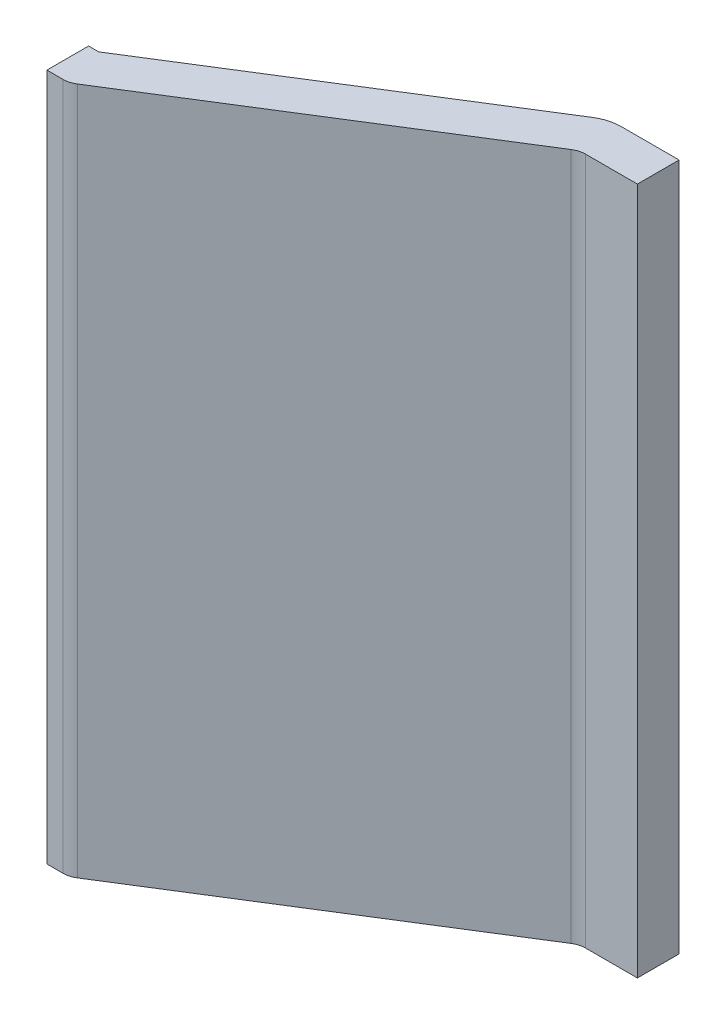
ISO-10303-21;
HEADER;
FILE_DESCRIPTION(('STEP AP214'),'2;1');
FILE_NAME('part.step','',(''),(''),'','','');
FILE_SCHEMA(('AUTOMOTIVE_DESIGN { 1 0 10303 214 1 1 1 1 }'));
ENDSEC;
DATA;
#1=APPLICATION_CONTEXT('core data for automotive mechanical design processes');
#2=APPLICATION_PROTOCOL_DEFINITION('international standard','automotive_design',2000,#1);
#3=PRODUCT_CONTEXT('',#1,'mechanical');
#4=PRODUCT('Part','Part','',(#3));
#5=PRODUCT_RELATED_PRODUCT_CATEGORY('part','',(#4));
#6=PRODUCT_DEFINITION_FORMATION('','',#4);
#7=PRODUCT_DEFINITION_CONTEXT('part definition',#1,'design');
#8=PRODUCT_DEFINITION('design','',#6,#7);
#9=PRODUCT_DEFINITION_SHAPE('','',#8);
#10=(LENGTH_UNIT() NAMED_UNIT(*) SI_UNIT(.MILLI.,.METRE.));
#11=(NAMED_UNIT(*) PLANE_ANGLE_UNIT() SI_UNIT($,.RADIAN.));
#12=(NAMED_UNIT(*) SI_UNIT($,.STERADIAN.) SOLID_ANGLE_UNIT());
#13=UNCERTAINTY_MEASURE_WITH_UNIT(LENGTH_MEASURE(1.E-05),#10,'distance_accuracy_value','');
#14=(GEOMETRIC_REPRESENTATION_CONTEXT(3) GLOBAL_UNCERTAINTY_ASSIGNED_CONTEXT((#13)) GLOBAL_UNIT_ASSIGNED_CONTEXT((#10,
#11,#12)) REPRESENTATION_CONTEXT('',''));
#15=CARTESIAN_POINT('',(0.,0.,0.));
#16=DIRECTION('',(0.,0.,1.));
#17=DIRECTION('',(1.,0.,0.));
#18=AXIS2_PLACEMENT_3D('',#15,#16,#17);
#19=CARTESIAN_POINT('',(1.824104576066,-1.525,0.964303036979));
#20=DIRECTION('',(0.,1.,0.));
#21=DIRECTION('',(0.530661276733133,0.,0.847583983671212));
#22=AXIS2_PLACEMENT_3D('',#19,#20,#21);
#23=CYLINDRICAL_SURFACE('',#22,0.0925);
#24=DIRECTION('',(0.,1.,0.));
#25=VECTOR('',#24,1.);
#26=CARTESIAN_POINT('',(1.873190744164,-1.525,1.042704555469));
#27=LINE('',#26,#25);
#28=CARTESIAN_POINT('',(1.873190744164,-1.525,1.042704555469));
#29=VERTEX_POINT('',#28);
#30=CARTESIAN_POINT('',(1.873190744164,1.525,1.042704555469));
#31=VERTEX_POINT('',#30);
#32=EDGE_CURVE('E25',#29,#31,#27,.T.);
#33=ORIENTED_EDGE('',*,*,#32,.T.);
#34=CARTESIAN_POINT('',(1.824104576066,1.525,0.964303036979));
#35=DIRECTION('',(0.,-1.,0.));
#36=DIRECTION('',(0.,0.,1.));
#37=AXIS2_PLACEMENT_3D('',#34,#35,#36);
#38=CIRCLE('',#37,0.0925);
#39=CARTESIAN_POINT('',(1.824104576066,1.525,1.056803036979));
#40=VERTEX_POINT('',#39);
#41=EDGE_CURVE('E178',#31,#40,#38,.T.);
#42=ORIENTED_EDGE('',*,*,#41,.T.);
#43=DIRECTION('',(0.,1.,0.));
#44=VECTOR('',#43,1.);
#45=CARTESIAN_POINT('',(1.824104576066,-1.525,1.056803036979));
#46=LINE('',#45,#44);
#47=CARTESIAN_POINT('',(1.824104576066,-1.525,1.056803036979));
#48=VERTEX_POINT('',#47);
#49=EDGE_CURVE('E11',#48,#40,#46,.T.);
#50=ORIENTED_EDGE('',*,*,#49,.F.);
#51=CARTESIAN_POINT('',(1.824104576066,-1.525,0.964303036979));
#52=DIRECTION('',(0.,-1.,0.));
#53=DIRECTION('',(0.,0.,1.));
#54=AXIS2_PLACEMENT_3D('',#51,#52,#53);
#55=CIRCLE('',#54,0.0925);
#56=EDGE_CURVE('E193',#29,#48,#55,.T.);
#57=ORIENTED_EDGE('',*,*,#56,.F.);
#58=EDGE_LOOP('',(#33,#42,#50,#57));
#59=FACE_BOUND('',#58,.T.);
#60=ADVANCED_FACE('F17',(#59),#23,.T.);
#61=CARTESIAN_POINT('',(1.7525,-1.525,1.056803036979));
#62=DIRECTION('',(0.,0.,1.));
#63=DIRECTION('',(1.,0.,0.));
#64=AXIS2_PLACEMENT_3D('',#61,#62,#63);
#65=PLANE('',#64);
#66=DIRECTION('',(1.,0.,0.));
#67=VECTOR('',#66,1.);
#68=CARTESIAN_POINT('',(1.7525,1.525,1.056803036979));
#69=LINE('',#68,#67);
#70=CARTESIAN_POINT('',(1.7525,1.525,1.056803036979));
#71=VERTEX_POINT('',#70);
#72=EDGE_CURVE('E187',#71,#40,#69,.T.);
#73=ORIENTED_EDGE('',*,*,#72,.F.);
#74=DIRECTION('',(0.,1.,0.));
#75=VECTOR('',#74,1.);
#76=CARTESIAN_POINT('',(1.7525,-1.525,1.056803036979));
#77=LINE('',#76,#75);
#78=CARTESIAN_POINT('',(1.7525,-1.525,1.056803036979));
#79=VERTEX_POINT('',#78);
#80=EDGE_CURVE('E250',#79,#71,#77,.T.);
#81=ORIENTED_EDGE('',*,*,#80,.F.);
#82=DIRECTION('',(1.,0.,0.));
#83=VECTOR('',#82,1.);
#84=CARTESIAN_POINT('',(1.7525,-1.525,1.056803036979));
#85=LINE('',#84,#83);
#86=EDGE_CURVE('E197',#79,#48,#85,.T.);
#87=ORIENTED_EDGE('',*,*,#86,.T.);
#88=ORIENTED_EDGE('',*,*,#49,.T.);
#89=EDGE_LOOP('',(#73,#81,#87,#88));
#90=FACE_BOUND('',#89,.T.);
#91=ADVANCED_FACE('F265',(#90),#65,.T.);
#92=CARTESIAN_POINT('',(3.288172336196,-1.525,0.156803036979));
#93=DIRECTION('',(0.530661276733133,0.,0.847583983671212));
#94=DIRECTION('',(0.,-1.,0.));
#95=AXIS2_PLACEMENT_3D('',#92,#93,#94);
#96=PLANE('',#95);
#97=DIRECTION('',(-0.847583983671212,0.,0.530661276733133));
#98=VECTOR('',#97,1.);
#99=CARTESIAN_POINT('',(3.288172336196,-1.525,0.156803036979));
#100=LINE('',#99,#98);
#101=CARTESIAN_POINT('',(3.220617112292,-1.525,0.19909848151));
#102=VERTEX_POINT('',#101);
#103=EDGE_CURVE('E198',#102,#29,#100,.T.);
#104=ORIENTED_EDGE('',*,*,#103,.F.);
#105=DIRECTION('',(0.,1.,0.));
#106=VECTOR('',#105,1.);
#107=CARTESIAN_POINT('',(3.220617112292,-1.525,0.19909848151));
#108=LINE('',#107,#106);
#109=CARTESIAN_POINT('',(3.220617112292,1.525,0.19909848151));
#110=VERTEX_POINT('',#109);
#111=EDGE_CURVE('E141',#102,#110,#108,.T.);
#112=ORIENTED_EDGE('',*,*,#111,.T.);
#113=DIRECTION('',(-0.847583983671212,0.,0.530661276733133));
#114=VECTOR('',#113,1.);
#115=CARTESIAN_POINT('',(3.288172336196,1.525,0.156803036979));
#116=LINE('',#115,#114);
#117=EDGE_CURVE('E174',#110,#31,#116,.T.);
#118=ORIENTED_EDGE('',*,*,#117,.T.);
#119=ORIENTED_EDGE('',*,*,#32,.F.);
#120=EDGE_LOOP('',(#104,#112,#118,#119));
#121=FACE_BOUND('',#120,.T.);
#122=ADVANCED_FACE('F259',(#121),#96,.T.);
#123=CARTESIAN_POINT('',(1.7525,-1.525,0.871803036979));
#124=DIRECTION('',(1.,0.,0.));
#125=DIRECTION('',(0.,1.,0.));
#126=AXIS2_PLACEMENT_3D('',#123,#124,#125);
#127=PLANE('',#126);
#128=DIRECTION('',(0.,0.,1.));
#129=VECTOR('',#128,1.);
#130=CARTESIAN_POINT('',(1.7525,-1.525,0.871803036979));
#131=LINE('',#130,#129);
#132=CARTESIAN_POINT('',(1.7525,-1.525,0.871803036979));
#133=VERTEX_POINT('',#132);
#134=EDGE_CURVE('E223',#133,#79,#131,.T.);
#135=ORIENTED_EDGE('',*,*,#134,.T.);
#136=ORIENTED_EDGE('',*,*,#80,.T.);
#137=DIRECTION('',(0.,0.,1.));
#138=VECTOR('',#137,1.);
#139=CARTESIAN_POINT('',(1.7525,1.525,0.871803036979));
#140=LINE('',#139,#138);
#141=CARTESIAN_POINT('',(1.7525,1.525,0.871803036979));
#142=VERTEX_POINT('',#141);
#143=EDGE_CURVE('E203',#142,#71,#140,.T.);
#144=ORIENTED_EDGE('',*,*,#143,.F.);
#145=DIRECTION('',(0.,1.,0.));
#146=VECTOR('',#145,1.);
#147=CARTESIAN_POINT('',(1.7525,-1.525,0.871803036979));
#148=LINE('',#147,#146);
#149=EDGE_CURVE('E190',#133,#142,#148,.T.);
#150=ORIENTED_EDGE('',*,*,#149,.F.);
#151=EDGE_LOOP('',(#135,#136,#144,#150));
#152=FACE_BOUND('',#151,.T.);
#153=ADVANCED_FACE('F290',(#152),#127,.F.);
#154=CARTESIAN_POINT('',(1.7525,-1.525,0.871803036979));
#155=DIRECTION('',(0.,0.,1.));
#156=DIRECTION('',(1.,0.,0.));
#157=AXIS2_PLACEMENT_3D('',#154,#155,#156);
#158=PLANE('',#157);
#159=DIRECTION('',(0.,1.,0.));
#160=VECTOR('',#159,1.);
#161=CARTESIAN_POINT('',(1.797536815936,-1.525,0.871803036979));
#162=LINE('',#161,#160);
#163=CARTESIAN_POINT('',(1.797536815936,-1.525,0.871803036979));
#164=VERTEX_POINT('',#163);
#165=CARTESIAN_POINT('',(1.797536815936,1.525,0.871803036979));
#166=VERTEX_POINT('',#165);
#167=EDGE_CURVE('E47',#164,#166,#162,.T.);
#168=ORIENTED_EDGE('',*,*,#167,.F.);
#169=DIRECTION('',(1.,0.,0.));
#170=VECTOR('',#169,1.);
#171=CARTESIAN_POINT('',(1.7525,-1.525,0.871803036979));
#172=LINE('',#171,#170);
#173=EDGE_CURVE('E218',#133,#164,#172,.T.);
#174=ORIENTED_EDGE('',*,*,#173,.F.);
#175=ORIENTED_EDGE('',*,*,#149,.T.);
#176=DIRECTION('',(1.,0.,0.));
#177=VECTOR('',#176,1.);
#178=CARTESIAN_POINT('',(1.7525,1.525,0.871803036979));
#179=LINE('',#178,#177);
#180=EDGE_CURVE('E202',#142,#166,#179,.T.);
#181=ORIENTED_EDGE('',*,*,#180,.T.);
#182=EDGE_LOOP('',(#168,#174,#175,#181));
#183=FACE_BOUND('',#182,.T.);
#184=ADVANCED_FACE('F361',(#183),#158,.F.);
#185=CARTESIAN_POINT('',(3.19,-1.525,0.));
#186=DIRECTION('',(0.530661276733133,0.,0.847583983671212));
#187=DIRECTION('',(0.,-1.,0.));
#188=AXIS2_PLACEMENT_3D('',#185,#186,#187);
#189=PLANE('',#188);
#190=ORIENTED_EDGE('',*,*,#167,.T.);
#191=DIRECTION('',(-0.847583983671212,0.,0.530661276733133));
#192=VECTOR('',#191,1.);
#193=CARTESIAN_POINT('',(3.19,1.525,0.));
#194=LINE('',#193,#192);
#195=CARTESIAN_POINT('',(3.144963184064,1.525,0.02819696302084));
#196=VERTEX_POINT('',#195);
#197=EDGE_CURVE('E182',#196,#166,#194,.T.);
#198=ORIENTED_EDGE('',*,*,#197,.F.);
#199=DIRECTION('',(0.,1.,0.));
#200=VECTOR('',#199,1.);
#201=CARTESIAN_POINT('',(3.144963184064,-1.525,0.02819696302084));
#202=LINE('',#201,#200);
#203=CARTESIAN_POINT('',(3.144963184064,-1.525,0.02819696302084));
#204=VERTEX_POINT('',#203);
#205=EDGE_CURVE('E37',#204,#196,#202,.T.);
#206=ORIENTED_EDGE('',*,*,#205,.F.);
#207=DIRECTION('',(-0.847583983671212,0.,0.530661276733133));
#208=VECTOR('',#207,1.);
#209=CARTESIAN_POINT('',(3.19,-1.525,0.));
#210=LINE('',#209,#208);
#211=EDGE_CURVE('E222',#204,#164,#210,.T.);
#212=ORIENTED_EDGE('',*,*,#211,.T.);
#213=EDGE_LOOP('',(#190,#198,#206,#212));
#214=FACE_BOUND('',#213,.T.);
#215=ADVANCED_FACE('F350',(#214),#189,.F.);
#216=CARTESIAN_POINT('',(3.24313552026,-1.525,0.185));
#217=DIRECTION('',(0.,1.,0.));
#218=DIRECTION('',(0.,0.,-1.));
#219=AXIS2_PLACEMENT_3D('',#216,#217,#218);
#220=CYLINDRICAL_SURFACE('',#219,0.185);
#221=CARTESIAN_POINT('',(3.24313552026,-1.525,0.185));
#222=DIRECTION('',(0.,1.,0.));
#223=DIRECTION('',(0.,0.,1.));
#224=AXIS2_PLACEMENT_3D('',#221,#222,#223);
#225=CIRCLE('',#224,0.185);
#226=CARTESIAN_POINT('',(3.24313552026,-1.525,0.));
#227=VERTEX_POINT('',#226);
#228=EDGE_CURVE('E240',#227,#204,#225,.T.);
#229=ORIENTED_EDGE('',*,*,#228,.T.);
#230=ORIENTED_EDGE('',*,*,#205,.T.);
#231=CARTESIAN_POINT('',(3.24313552026,1.525,0.185));
#232=DIRECTION('',(0.,1.,0.));
#233=DIRECTION('',(0.,0.,1.));
#234=AXIS2_PLACEMENT_3D('',#231,#232,#233);
#235=CIRCLE('',#234,0.185);
#236=CARTESIAN_POINT('',(3.24313552026,1.525,0.));
#237=VERTEX_POINT('',#236);
#238=EDGE_CURVE('E179',#237,#196,#235,.T.);
#239=ORIENTED_EDGE('',*,*,#238,.F.);
#240=DIRECTION('',(0.,1.,0.));
#241=VECTOR('',#240,1.);
#242=CARTESIAN_POINT('',(3.24313552026,-1.525,0.));
#243=LINE('',#242,#241);
#244=EDGE_CURVE('E243',#227,#237,#243,.T.);
#245=ORIENTED_EDGE('',*,*,#244,.F.);
#246=EDGE_LOOP('',(#229,#230,#239,#245));
#247=FACE_BOUND('',#246,.T.);
#248=ADVANCED_FACE('F339',(#247),#220,.T.);
#249=CARTESIAN_POINT('',(3.19,-1.525,0.));
#250=DIRECTION('',(0.,0.,1.));
#251=DIRECTION('',(1.,0.,0.));
#252=AXIS2_PLACEMENT_3D('',#249,#250,#251);
#253=PLANE('',#252);
#254=ORIENTED_EDGE('',*,*,#244,.T.);
#255=DIRECTION('',(1.,0.,0.));
#256=VECTOR('',#255,1.);
#257=CARTESIAN_POINT('',(3.19,1.525,0.));
#258=LINE('',#257,#256);
#259=CARTESIAN_POINT('',(3.5,1.525,0.));
#260=VERTEX_POINT('',#259);
#261=EDGE_CURVE('E152',#237,#260,#258,.T.);
#262=ORIENTED_EDGE('',*,*,#261,.T.);
#263=DIRECTION('',(0.,1.,0.));
#264=VECTOR('',#263,1.);
#265=CARTESIAN_POINT('',(3.5,-1.525,0.));
#266=LINE('',#265,#264);
#267=CARTESIAN_POINT('',(3.5,-1.525,0.));
#268=VERTEX_POINT('',#267);
#269=EDGE_CURVE('E135',#268,#260,#266,.T.);
#270=ORIENTED_EDGE('',*,*,#269,.F.);
#271=DIRECTION('',(1.,0.,0.));
#272=VECTOR('',#271,1.);
#273=CARTESIAN_POINT('',(3.19,-1.525,0.));
#274=LINE('',#273,#272);
#275=EDGE_CURVE('E226',#227,#268,#274,.T.);
#276=ORIENTED_EDGE('',*,*,#275,.F.);
#277=EDGE_LOOP('',(#254,#262,#270,#276));
#278=FACE_BOUND('',#277,.T.);
#279=ADVANCED_FACE('F329',(#278),#253,.F.);
#280=CARTESIAN_POINT('',(2.614100714426,-1.525,0.486101794686));
#281=DIRECTION('',(0.,-1.,0.));
#282=DIRECTION('',(0.,0.,-1.));
#283=AXIS2_PLACEMENT_3D('',#280,#281,#282);
#284=PLANE('',#283);
#285=ORIENTED_EDGE('',*,*,#275,.T.);
#286=DIRECTION('',(0.,0.,1.));
#287=VECTOR('',#286,1.);
#288=CARTESIAN_POINT('',(3.5,-1.525,0.));
#289=LINE('',#288,#287);
#290=CARTESIAN_POINT('',(3.5,-1.525,0.185));
#291=VERTEX_POINT('',#290);
#292=EDGE_CURVE('E173',#268,#291,#289,.T.);
#293=ORIENTED_EDGE('',*,*,#292,.T.);
#294=DIRECTION('',(1.,0.,0.));
#295=VECTOR('',#294,1.);
#296=CARTESIAN_POINT('',(3.19,-1.525,0.185));
#297=LINE('',#296,#295);
#298=CARTESIAN_POINT('',(3.269703280389,-1.525,0.185));
#299=VERTEX_POINT('',#298);
#300=EDGE_CURVE('E150',#299,#291,#297,.T.);
#301=ORIENTED_EDGE('',*,*,#300,.F.);
#302=CARTESIAN_POINT('',(3.269703280389,-1.525,0.2775));
#303=DIRECTION('',(0.,1.,0.));
#304=DIRECTION('',(0.,0.,1.));
#305=AXIS2_PLACEMENT_3D('',#302,#303,#304);
#306=CIRCLE('',#305,0.0925);
#307=EDGE_CURVE('E169',#299,#102,#306,.T.);
#308=ORIENTED_EDGE('',*,*,#307,.T.);
#309=ORIENTED_EDGE('',*,*,#103,.T.);
#310=ORIENTED_EDGE('',*,*,#56,.T.);
#311=ORIENTED_EDGE('',*,*,#86,.F.);
#312=ORIENTED_EDGE('',*,*,#134,.F.);
#313=ORIENTED_EDGE('',*,*,#173,.T.);
#314=ORIENTED_EDGE('',*,*,#211,.F.);
#315=ORIENTED_EDGE('',*,*,#228,.F.);
#316=EDGE_LOOP('',(#285,#293,#301,#308,#309,#310,#311,#312,#313,#314,#315));
#317=FACE_BOUND('',#316,.T.);
#318=ADVANCED_FACE('F269',(#317),#284,.T.);
#319=CARTESIAN_POINT('',(3.5,-1.525,0.));
#320=DIRECTION('',(1.,0.,0.));
#321=DIRECTION('',(0.,1.,0.));
#322=AXIS2_PLACEMENT_3D('',#319,#320,#321);
#323=PLANE('',#322);
#324=ORIENTED_EDGE('',*,*,#292,.F.);
#325=ORIENTED_EDGE('',*,*,#269,.T.);
#326=DIRECTION('',(0.,0.,1.));
#327=VECTOR('',#326,1.);
#328=CARTESIAN_POINT('',(3.5,1.525,0.));
#329=LINE('',#328,#327);
#330=CARTESIAN_POINT('',(3.5,1.525,0.185));
#331=VERTEX_POINT('',#330);
#332=EDGE_CURVE('E128',#260,#331,#329,.T.);
#333=ORIENTED_EDGE('',*,*,#332,.T.);
#334=DIRECTION('',(0.,1.,0.));
#335=VECTOR('',#334,1.);
#336=CARTESIAN_POINT('',(3.5,-1.525,0.185));
#337=LINE('',#336,#335);
#338=EDGE_CURVE('E132',#291,#331,#337,.T.);
#339=ORIENTED_EDGE('',*,*,#338,.F.);
#340=EDGE_LOOP('',(#324,#325,#333,#339));
#341=FACE_BOUND('',#340,.T.);
#342=ADVANCED_FACE('F131',(#341),#323,.T.);
#343=CARTESIAN_POINT('',(3.269703280389,-1.525,0.2775));
#344=DIRECTION('',(0.,1.,0.));
#345=DIRECTION('',(0.,0.,-1.));
#346=AXIS2_PLACEMENT_3D('',#343,#344,#345);
#347=CYLINDRICAL_SURFACE('',#346,0.0925);
#348=DIRECTION('',(0.,1.,0.));
#349=VECTOR('',#348,1.);
#350=CARTESIAN_POINT('',(3.269703280389,-1.525,0.185));
#351=LINE('',#350,#349);
#352=CARTESIAN_POINT('',(3.269703280389,1.525,0.185));
#353=VERTEX_POINT('',#352);
#354=EDGE_CURVE('E159',#299,#353,#351,.T.);
#355=ORIENTED_EDGE('',*,*,#354,.T.);
#356=CARTESIAN_POINT('',(3.269703280389,1.525,0.2775));
#357=DIRECTION('',(0.,1.,0.));
#358=DIRECTION('',(0.,0.,1.));
#359=AXIS2_PLACEMENT_3D('',#356,#357,#358);
#360=CIRCLE('',#359,0.0925);
#361=EDGE_CURVE('E142',#353,#110,#360,.T.);
#362=ORIENTED_EDGE('',*,*,#361,.T.);
#363=ORIENTED_EDGE('',*,*,#111,.F.);
#364=ORIENTED_EDGE('',*,*,#307,.F.);
#365=EDGE_LOOP('',(#355,#362,#363,#364));
#366=FACE_BOUND('',#365,.T.);
#367=ADVANCED_FACE('F271',(#366),#347,.F.);
#368=CARTESIAN_POINT('',(2.614100714426,1.525,0.486101794686));
#369=DIRECTION('',(0.,1.,0.));
#370=DIRECTION('',(0.,0.,-1.));
#371=AXIS2_PLACEMENT_3D('',#368,#369,#370);
#372=PLANE('',#371);
#373=ORIENTED_EDGE('',*,*,#261,.F.);
#374=ORIENTED_EDGE('',*,*,#238,.T.);
#375=ORIENTED_EDGE('',*,*,#197,.T.);
#376=ORIENTED_EDGE('',*,*,#180,.F.);
#377=ORIENTED_EDGE('',*,*,#143,.T.);
#378=ORIENTED_EDGE('',*,*,#72,.T.);
#379=ORIENTED_EDGE('',*,*,#41,.F.);
#380=ORIENTED_EDGE('',*,*,#117,.F.);
#381=ORIENTED_EDGE('',*,*,#361,.F.);
#382=DIRECTION('',(1.,0.,0.));
#383=VECTOR('',#382,1.);
#384=CARTESIAN_POINT('',(3.19,1.525,0.185));
#385=LINE('',#384,#383);
#386=EDGE_CURVE('E148',#353,#331,#385,.T.);
#387=ORIENTED_EDGE('',*,*,#386,.T.);
#388=ORIENTED_EDGE('',*,*,#332,.F.);
#389=EDGE_LOOP('',(#373,#374,#375,#376,#377,#378,#379,#380,#381,#387,#388));
#390=FACE_BOUND('',#389,.T.);
#391=ADVANCED_FACE('F154',(#390),#372,.T.);
#392=CARTESIAN_POINT('',(3.19,-1.525,0.185));
#393=DIRECTION('',(0.,0.,1.));
#394=DIRECTION('',(1.,0.,0.));
#395=AXIS2_PLACEMENT_3D('',#392,#393,#394);
#396=PLANE('',#395);
#397=ORIENTED_EDGE('',*,*,#386,.F.);
#398=ORIENTED_EDGE('',*,*,#354,.F.);
#399=ORIENTED_EDGE('',*,*,#300,.T.);
#400=ORIENTED_EDGE('',*,*,#338,.T.);
#401=EDGE_LOOP('',(#397,#398,#399,#400));
#402=FACE_BOUND('',#401,.T.);
#403=ADVANCED_FACE('F146',(#402),#396,.T.);
#404=CLOSED_SHELL('',(#60,#91,#122,#153,#184,#215,#248,#279,#318,#342,#367,#391,#403));
#405=MANIFOLD_SOLID_BREP('B1',#404);
#406=ADVANCED_BREP_SHAPE_REPRESENTATION('',(#18,#405),#14);
#407=SHAPE_DEFINITION_REPRESENTATION(#9,#406);
ENDSEC;
END-ISO-10303-21;
